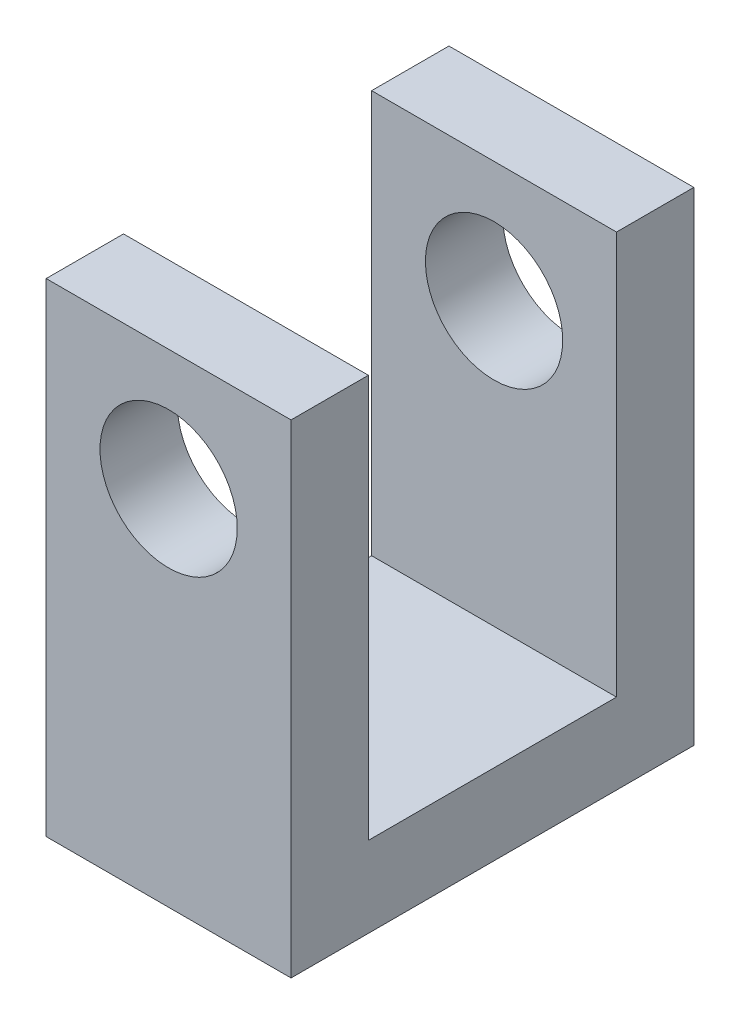
ISO-10303-21;
HEADER;
FILE_DESCRIPTION(('STEP AP214'),'2;1');
FILE_NAME('part.step','',(''),(''),'','','');
FILE_SCHEMA(('AUTOMOTIVE_DESIGN { 1 0 10303 214 1 1 1 1 }'));
ENDSEC;
DATA;
#1=APPLICATION_CONTEXT('core data for automotive mechanical design processes');
#2=APPLICATION_PROTOCOL_DEFINITION('international standard','automotive_design',2000,#1);
#3=PRODUCT_CONTEXT('',#1,'mechanical');
#4=PRODUCT('Part','Part','',(#3));
#5=PRODUCT_RELATED_PRODUCT_CATEGORY('part','',(#4));
#6=PRODUCT_DEFINITION_FORMATION('','',#4);
#7=PRODUCT_DEFINITION_CONTEXT('part definition',#1,'design');
#8=PRODUCT_DEFINITION('design','',#6,#7);
#9=PRODUCT_DEFINITION_SHAPE('','',#8);
#10=(LENGTH_UNIT() NAMED_UNIT(*) SI_UNIT(.MILLI.,.METRE.));
#11=(NAMED_UNIT(*) PLANE_ANGLE_UNIT() SI_UNIT($,.RADIAN.));
#12=(NAMED_UNIT(*) SI_UNIT($,.STERADIAN.) SOLID_ANGLE_UNIT());
#13=UNCERTAINTY_MEASURE_WITH_UNIT(LENGTH_MEASURE(1.E-05),#10,'distance_accuracy_value','');
#14=(GEOMETRIC_REPRESENTATION_CONTEXT(3) GLOBAL_UNCERTAINTY_ASSIGNED_CONTEXT((#13)) GLOBAL_UNIT_ASSIGNED_CONTEXT((#10,
#11,#12)) REPRESENTATION_CONTEXT('',''));
#15=CARTESIAN_POINT('',(0.,0.,0.));
#16=DIRECTION('',(0.,0.,1.));
#17=DIRECTION('',(1.,0.,0.));
#18=AXIS2_PLACEMENT_3D('',#15,#16,#17);
#19=CARTESIAN_POINT('',(0.,9.525,0.));
#20=DIRECTION('',(0.,1.,0.));
#21=DIRECTION('',(0.,0.,1.));
#22=AXIS2_PLACEMENT_3D('',#19,#20,#21);
#23=PLANE('',#22);
#24=DIRECTION('',(-1.,0.,0.));
#25=VECTOR('',#24,1.);
#26=CARTESIAN_POINT('',(2.413,9.525,-2.44475));
#27=LINE('',#26,#25);
#28=CARTESIAN_POINT('',(2.413,9.525,-2.44475));
#29=VERTEX_POINT('',#28);
#30=CARTESIAN_POINT('',(-2.413,9.525,-2.44475));
#31=VERTEX_POINT('',#30);
#32=EDGE_CURVE('E143',#29,#31,#27,.T.);
#33=ORIENTED_EDGE('',*,*,#32,.F.);
#34=DIRECTION('',(0.,0.,-1.));
#35=VECTOR('',#34,1.);
#36=CARTESIAN_POINT('',(2.413,9.525,3.96875));
#37=LINE('',#36,#35);
#38=CARTESIAN_POINT('',(2.413,9.525,-3.96875));
#39=VERTEX_POINT('',#38);
#40=EDGE_CURVE('E156',#29,#39,#37,.T.);
#41=ORIENTED_EDGE('',*,*,#40,.T.);
#42=DIRECTION('',(-1.,0.,0.));
#43=VECTOR('',#42,1.);
#44=CARTESIAN_POINT('',(2.413,9.525,-3.96875));
#45=LINE('',#44,#43);
#46=CARTESIAN_POINT('',(-2.413,9.525,-3.96875));
#47=VERTEX_POINT('',#46);
#48=EDGE_CURVE('E77',#39,#47,#45,.T.);
#49=ORIENTED_EDGE('',*,*,#48,.T.);
#50=DIRECTION('',(0.,0.,1.));
#51=VECTOR('',#50,1.);
#52=CARTESIAN_POINT('',(-2.413,9.525,3.96875));
#53=LINE('',#52,#51);
#54=EDGE_CURVE('E152',#47,#31,#53,.T.);
#55=ORIENTED_EDGE('',*,*,#54,.T.);
#56=EDGE_LOOP('',(#33,#41,#49,#55));
#57=FACE_BOUND('',#56,.T.);
#58=ADVANCED_FACE('F52',(#57),#23,.T.);
#59=CARTESIAN_POINT('',(-2.413,9.525,3.96875));
#60=DIRECTION('',(1.,0.,0.));
#61=DIRECTION('',(0.,0.,-1.));
#62=AXIS2_PLACEMENT_3D('',#59,#60,#61);
#63=PLANE('',#62);
#64=DIRECTION('',(0.,0.,1.));
#65=VECTOR('',#64,1.);
#66=CARTESIAN_POINT('',(-2.413,1.5875,-2.44475));
#67=LINE('',#66,#65);
#68=CARTESIAN_POINT('',(-2.413,1.5875,-2.44475));
#69=VERTEX_POINT('',#68);
#70=CARTESIAN_POINT('',(-2.413,1.5875,2.44475));
#71=VERTEX_POINT('',#70);
#72=EDGE_CURVE('E134',#69,#71,#67,.T.);
#73=ORIENTED_EDGE('',*,*,#72,.F.);
#74=DIRECTION('',(0.,1.,0.));
#75=VECTOR('',#74,1.);
#76=CARTESIAN_POINT('',(-2.413,1.5875,-2.44475));
#77=LINE('',#76,#75);
#78=EDGE_CURVE('E166',#69,#31,#77,.T.);
#79=ORIENTED_EDGE('',*,*,#78,.T.);
#80=ORIENTED_EDGE('',*,*,#54,.F.);
#81=DIRECTION('',(0.,-1.,0.));
#82=VECTOR('',#81,1.);
#83=CARTESIAN_POINT('',(-2.413,9.525,-3.96875));
#84=LINE('',#83,#82);
#85=CARTESIAN_POINT('',(-2.413,0.,-3.96875));
#86=VERTEX_POINT('',#85);
#87=EDGE_CURVE('E161',#47,#86,#84,.T.);
#88=ORIENTED_EDGE('',*,*,#87,.T.);
#89=DIRECTION('',(0.,0.,1.));
#90=VECTOR('',#89,1.);
#91=CARTESIAN_POINT('',(-2.413,0.,3.96875));
#92=LINE('',#91,#90);
#93=CARTESIAN_POINT('',(-2.413,0.,3.96875));
#94=VERTEX_POINT('',#93);
#95=EDGE_CURVE('E162',#86,#94,#92,.T.);
#96=ORIENTED_EDGE('',*,*,#95,.T.);
#97=DIRECTION('',(0.,-1.,0.));
#98=VECTOR('',#97,1.);
#99=CARTESIAN_POINT('',(-2.413,9.525,3.96875));
#100=LINE('',#99,#98);
#101=CARTESIAN_POINT('',(-2.413,9.525,3.96875));
#102=VERTEX_POINT('',#101);
#103=EDGE_CURVE('E13',#102,#94,#100,.T.);
#104=ORIENTED_EDGE('',*,*,#103,.F.);
#105=CARTESIAN_POINT('',(-2.413,9.525,2.44475));
#106=VERTEX_POINT('',#105);
#107=EDGE_CURVE('E105',#106,#102,#53,.T.);
#108=ORIENTED_EDGE('',*,*,#107,.F.);
#109=DIRECTION('',(0.,1.,0.));
#110=VECTOR('',#109,1.);
#111=CARTESIAN_POINT('',(-2.413,1.5875,2.44475));
#112=LINE('',#111,#110);
#113=EDGE_CURVE('E68',#71,#106,#112,.T.);
#114=ORIENTED_EDGE('',*,*,#113,.F.);
#115=EDGE_LOOP('',(#73,#79,#80,#88,#96,#104,#108,#114));
#116=FACE_BOUND('',#115,.T.);
#117=ADVANCED_FACE('F54',(#116),#63,.F.);
#118=CARTESIAN_POINT('',(2.413,9.525,3.96875));
#119=DIRECTION('',(0.,0.,-1.));
#120=DIRECTION('',(-1.,0.,0.));
#121=AXIS2_PLACEMENT_3D('',#118,#119,#120);
#122=PLANE('',#121);
#123=CARTESIAN_POINT('',(0.,7.14375,3.96875));
#124=DIRECTION('',(0.,0.,1.));
#125=DIRECTION('',(1.,0.,0.));
#126=AXIS2_PLACEMENT_3D('',#123,#124,#125);
#127=CIRCLE('',#126,1.35254999999999);
#128=CARTESIAN_POINT('',(1.35254999999999,7.14375,3.96875));
#129=VERTEX_POINT('',#128);
#130=EDGE_CURVE('E228',#129,#129,#127,.T.);
#131=ORIENTED_EDGE('',*,*,#130,.F.);
#132=EDGE_LOOP('',(#131));
#133=FACE_BOUND('',#132,.T.);
#134=DIRECTION('',(1.,0.,0.));
#135=VECTOR('',#134,1.);
#136=CARTESIAN_POINT('',(2.413,0.,3.96875));
#137=LINE('',#136,#135);
#138=CARTESIAN_POINT('',(2.413,0.,3.96875));
#139=VERTEX_POINT('',#138);
#140=EDGE_CURVE('E165',#94,#139,#137,.T.);
#141=ORIENTED_EDGE('',*,*,#140,.T.);
#142=DIRECTION('',(0.,-1.,0.));
#143=VECTOR('',#142,1.);
#144=CARTESIAN_POINT('',(2.413,9.525,3.96875));
#145=LINE('',#144,#143);
#146=CARTESIAN_POINT('',(2.413,9.525,3.96875));
#147=VERTEX_POINT('',#146);
#148=EDGE_CURVE('E61',#147,#139,#145,.T.);
#149=ORIENTED_EDGE('',*,*,#148,.F.);
#150=DIRECTION('',(1.,0.,0.));
#151=VECTOR('',#150,1.);
#152=CARTESIAN_POINT('',(2.413,9.525,3.96875));
#153=LINE('',#152,#151);
#154=EDGE_CURVE('E154',#102,#147,#153,.T.);
#155=ORIENTED_EDGE('',*,*,#154,.F.);
#156=ORIENTED_EDGE('',*,*,#103,.T.);
#157=EDGE_LOOP('',(#141,#149,#155,#156));
#158=FACE_BOUND('',#157,.T.);
#159=ADVANCED_FACE('F215',(#133,#158),#122,.F.);
#160=CARTESIAN_POINT('',(2.413,9.525,3.96875));
#161=DIRECTION('',(-1.,0.,0.));
#162=DIRECTION('',(0.,0.,1.));
#163=AXIS2_PLACEMENT_3D('',#160,#161,#162);
#164=PLANE('',#163);
#165=ORIENTED_EDGE('',*,*,#40,.F.);
#166=DIRECTION('',(0.,1.,0.));
#167=VECTOR('',#166,1.);
#168=CARTESIAN_POINT('',(2.413,1.5875,-2.44475));
#169=LINE('',#168,#167);
#170=CARTESIAN_POINT('',(2.413,1.5875,-2.44475));
#171=VERTEX_POINT('',#170);
#172=EDGE_CURVE('E147',#171,#29,#169,.T.);
#173=ORIENTED_EDGE('',*,*,#172,.F.);
#174=DIRECTION('',(0.,0.,-1.));
#175=VECTOR('',#174,1.);
#176=CARTESIAN_POINT('',(2.413,1.5875,-2.44475));
#177=LINE('',#176,#175);
#178=CARTESIAN_POINT('',(2.413,1.5875,2.44475));
#179=VERTEX_POINT('',#178);
#180=EDGE_CURVE('E133',#179,#171,#177,.T.);
#181=ORIENTED_EDGE('',*,*,#180,.F.);
#182=DIRECTION('',(0.,1.,0.));
#183=VECTOR('',#182,1.);
#184=CARTESIAN_POINT('',(2.413,1.5875,2.44475));
#185=LINE('',#184,#183);
#186=CARTESIAN_POINT('',(2.413,9.525,2.44475));
#187=VERTEX_POINT('',#186);
#188=EDGE_CURVE('E130',#179,#187,#185,.T.);
#189=ORIENTED_EDGE('',*,*,#188,.T.);
#190=EDGE_CURVE('E157',#147,#187,#37,.T.);
#191=ORIENTED_EDGE('',*,*,#190,.F.);
#192=ORIENTED_EDGE('',*,*,#148,.T.);
#193=DIRECTION('',(0.,0.,-1.));
#194=VECTOR('',#193,1.);
#195=CARTESIAN_POINT('',(2.413,0.,3.96875));
#196=LINE('',#195,#194);
#197=CARTESIAN_POINT('',(2.413,0.,-3.96875));
#198=VERTEX_POINT('',#197);
#199=EDGE_CURVE('E168',#139,#198,#196,.T.);
#200=ORIENTED_EDGE('',*,*,#199,.T.);
#201=DIRECTION('',(0.,-1.,0.));
#202=VECTOR('',#201,1.);
#203=CARTESIAN_POINT('',(2.413,9.525,-3.96875));
#204=LINE('',#203,#202);
#205=EDGE_CURVE('E172',#39,#198,#204,.T.);
#206=ORIENTED_EDGE('',*,*,#205,.F.);
#207=EDGE_LOOP('',(#165,#173,#181,#189,#191,#192,#200,#206));
#208=FACE_BOUND('',#207,.T.);
#209=ADVANCED_FACE('F180',(#208),#164,.F.);
#210=CARTESIAN_POINT('',(2.413,9.525,-3.96875));
#211=DIRECTION('',(0.,0.,1.));
#212=DIRECTION('',(1.,0.,0.));
#213=AXIS2_PLACEMENT_3D('',#210,#211,#212);
#214=PLANE('',#213);
#215=CARTESIAN_POINT('',(0.,7.14375,-3.96875));
#216=DIRECTION('',(0.,0.,1.));
#217=DIRECTION('',(1.,0.,0.));
#218=AXIS2_PLACEMENT_3D('',#215,#216,#217);
#219=CIRCLE('',#218,1.35254999999999);
#220=CARTESIAN_POINT('',(1.35254999999999,7.14375,-3.96875));
#221=VERTEX_POINT('',#220);
#222=EDGE_CURVE('E193',#221,#221,#219,.T.);
#223=ORIENTED_EDGE('',*,*,#222,.T.);
#224=EDGE_LOOP('',(#223));
#225=FACE_BOUND('',#224,.T.);
#226=DIRECTION('',(-1.,0.,0.));
#227=VECTOR('',#226,1.);
#228=CARTESIAN_POINT('',(2.413,0.,-3.96875));
#229=LINE('',#228,#227);
#230=EDGE_CURVE('E98',#198,#86,#229,.T.);
#231=ORIENTED_EDGE('',*,*,#230,.T.);
#232=ORIENTED_EDGE('',*,*,#87,.F.);
#233=ORIENTED_EDGE('',*,*,#48,.F.);
#234=ORIENTED_EDGE('',*,*,#205,.T.);
#235=EDGE_LOOP('',(#231,#232,#233,#234));
#236=FACE_BOUND('',#235,.T.);
#237=ADVANCED_FACE('F187',(#225,#236),#214,.F.);
#238=DIRECTION('',(1.,0.,0.));
#239=VECTOR('',#238,1.);
#240=CARTESIAN_POINT('',(2.413,9.525,2.44475));
#241=LINE('',#240,#239);
#242=EDGE_CURVE('E191',#106,#187,#241,.T.);
#243=ORIENTED_EDGE('',*,*,#242,.F.);
#244=ORIENTED_EDGE('',*,*,#107,.T.);
#245=ORIENTED_EDGE('',*,*,#154,.T.);
#246=ORIENTED_EDGE('',*,*,#190,.T.);
#247=EDGE_LOOP('',(#243,#244,#245,#246));
#248=FACE_BOUND('',#247,.T.);
#249=ADVANCED_FACE('F206',(#248),#23,.T.);
#250=CARTESIAN_POINT('',(0.,0.,0.));
#251=DIRECTION('',(0.,1.,0.));
#252=DIRECTION('',(0.,0.,1.));
#253=AXIS2_PLACEMENT_3D('',#250,#251,#252);
#254=PLANE('',#253);
#255=ORIENTED_EDGE('',*,*,#95,.F.);
#256=ORIENTED_EDGE('',*,*,#230,.F.);
#257=ORIENTED_EDGE('',*,*,#199,.F.);
#258=ORIENTED_EDGE('',*,*,#140,.F.);
#259=EDGE_LOOP('',(#255,#256,#257,#258));
#260=FACE_BOUND('',#259,.T.);
#261=ADVANCED_FACE('F185',(#260),#254,.F.);
#262=CARTESIAN_POINT('',(2.413,1.5875,-2.44475));
#263=DIRECTION('',(0.,0.,-1.));
#264=DIRECTION('',(-1.,0.,0.));
#265=AXIS2_PLACEMENT_3D('',#262,#263,#264);
#266=PLANE('',#265);
#267=CARTESIAN_POINT('',(0.,7.14375,-2.44475));
#268=DIRECTION('',(0.,0.,-1.));
#269=DIRECTION('',(-1.,0.,0.));
#270=AXIS2_PLACEMENT_3D('',#267,#268,#269);
#271=CIRCLE('',#270,1.35254999999999);
#272=CARTESIAN_POINT('',(-1.35254999999999,7.14375,-2.44475));
#273=VERTEX_POINT('',#272);
#274=EDGE_CURVE('E226',#273,#273,#271,.T.);
#275=ORIENTED_EDGE('',*,*,#274,.T.);
#276=EDGE_LOOP('',(#275));
#277=FACE_BOUND('',#276,.T.);
#278=ORIENTED_EDGE('',*,*,#32,.T.);
#279=ORIENTED_EDGE('',*,*,#78,.F.);
#280=DIRECTION('',(-1.,0.,0.));
#281=VECTOR('',#280,1.);
#282=CARTESIAN_POINT('',(2.413,1.5875,-2.44475));
#283=LINE('',#282,#281);
#284=EDGE_CURVE('E140',#171,#69,#283,.T.);
#285=ORIENTED_EDGE('',*,*,#284,.F.);
#286=ORIENTED_EDGE('',*,*,#172,.T.);
#287=EDGE_LOOP('',(#278,#279,#285,#286));
#288=FACE_BOUND('',#287,.T.);
#289=ADVANCED_FACE('F196',(#277,#288),#266,.F.);
#290=CARTESIAN_POINT('',(2.413,1.5875,2.44475));
#291=DIRECTION('',(0.,0.,1.));
#292=DIRECTION('',(1.,0.,0.));
#293=AXIS2_PLACEMENT_3D('',#290,#291,#292);
#294=PLANE('',#293);
#295=CARTESIAN_POINT('',(0.,7.14375,2.44475));
#296=DIRECTION('',(0.,0.,1.));
#297=DIRECTION('',(1.,0.,0.));
#298=AXIS2_PLACEMENT_3D('',#295,#296,#297);
#299=CIRCLE('',#298,1.35254999999999);
#300=CARTESIAN_POINT('',(1.35254999999999,7.14375,2.44475));
#301=VERTEX_POINT('',#300);
#302=EDGE_CURVE('E56',#301,#301,#299,.T.);
#303=ORIENTED_EDGE('',*,*,#302,.T.);
#304=EDGE_LOOP('',(#303));
#305=FACE_BOUND('',#304,.T.);
#306=ORIENTED_EDGE('',*,*,#242,.T.);
#307=ORIENTED_EDGE('',*,*,#188,.F.);
#308=DIRECTION('',(1.,0.,0.));
#309=VECTOR('',#308,1.);
#310=CARTESIAN_POINT('',(2.413,1.5875,2.44475));
#311=LINE('',#310,#309);
#312=EDGE_CURVE('E126',#71,#179,#311,.T.);
#313=ORIENTED_EDGE('',*,*,#312,.F.);
#314=ORIENTED_EDGE('',*,*,#113,.T.);
#315=EDGE_LOOP('',(#306,#307,#313,#314));
#316=FACE_BOUND('',#315,.T.);
#317=ADVANCED_FACE('F128',(#305,#316),#294,.F.);
#318=CARTESIAN_POINT('',(0.,1.5875,0.));
#319=DIRECTION('',(0.,-1.,0.));
#320=DIRECTION('',(0.,0.,-1.));
#321=AXIS2_PLACEMENT_3D('',#318,#319,#320);
#322=PLANE('',#321);
#323=ORIENTED_EDGE('',*,*,#72,.T.);
#324=ORIENTED_EDGE('',*,*,#312,.T.);
#325=ORIENTED_EDGE('',*,*,#180,.T.);
#326=ORIENTED_EDGE('',*,*,#284,.T.);
#327=EDGE_LOOP('',(#323,#324,#325,#326));
#328=FACE_BOUND('',#327,.T.);
#329=ADVANCED_FACE('F138',(#328),#322,.F.);
#330=CARTESIAN_POINT('',(0.,7.14375,3.96875));
#331=DIRECTION('',(0.,0.,1.));
#332=DIRECTION('',(1.,0.,0.));
#333=AXIS2_PLACEMENT_3D('',#330,#331,#332);
#334=CYLINDRICAL_SURFACE('',#333,1.35254999999999);
#335=ORIENTED_EDGE('',*,*,#130,.T.);
#336=EDGE_LOOP('',(#335));
#337=FACE_BOUND('',#336,.T.);
#338=ORIENTED_EDGE('',*,*,#302,.F.);
#339=EDGE_LOOP('',(#338));
#340=FACE_BOUND('',#339,.T.);
#341=ADVANCED_FACE('F235',(#337,#340),#334,.F.);
#342=ORIENTED_EDGE('',*,*,#274,.F.);
#343=EDGE_LOOP('',(#342));
#344=FACE_BOUND('',#343,.T.);
#345=ORIENTED_EDGE('',*,*,#222,.F.);
#346=EDGE_LOOP('',(#345));
#347=FACE_BOUND('',#346,.T.);
#348=ADVANCED_FACE('F237',(#344,#347),#334,.F.);
#349=CLOSED_SHELL('',(#58,#117,#159,#209,#237,#249,#261,#289,#317,#329,#341,#348));
#350=MANIFOLD_SOLID_BREP('B2',#349);
#351=ADVANCED_BREP_SHAPE_REPRESENTATION('',(#18,#350),#14);
#352=SHAPE_DEFINITION_REPRESENTATION(#9,#351);
ENDSEC;
END-ISO-10303-21;
